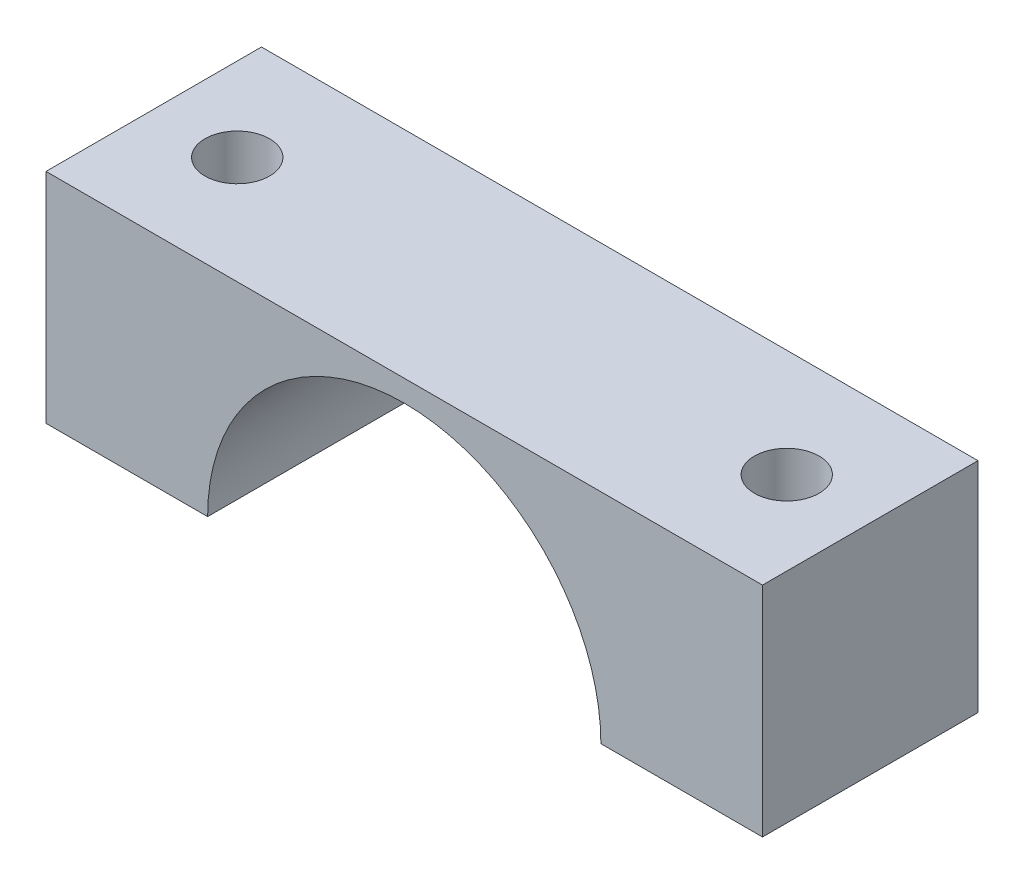
ISO-10303-21;
HEADER;
FILE_DESCRIPTION(('STEP AP214'),'2;1');
FILE_NAME('part.step','',(''),(''),'','','');
FILE_SCHEMA(('AUTOMOTIVE_DESIGN { 1 0 10303 214 1 1 1 1 }'));
ENDSEC;
DATA;
#1=APPLICATION_CONTEXT('core data for automotive mechanical design processes');
#2=APPLICATION_PROTOCOL_DEFINITION('international standard','automotive_design',2000,#1);
#3=PRODUCT_CONTEXT('',#1,'mechanical');
#4=PRODUCT('Part','Part','',(#3));
#5=PRODUCT_RELATED_PRODUCT_CATEGORY('part','',(#4));
#6=PRODUCT_DEFINITION_FORMATION('','',#4);
#7=PRODUCT_DEFINITION_CONTEXT('part definition',#1,'design');
#8=PRODUCT_DEFINITION('design','',#6,#7);
#9=PRODUCT_DEFINITION_SHAPE('','',#8);
#10=(LENGTH_UNIT() NAMED_UNIT(*) SI_UNIT(.MILLI.,.METRE.));
#11=(NAMED_UNIT(*) PLANE_ANGLE_UNIT() SI_UNIT($,.RADIAN.));
#12=(NAMED_UNIT(*) SI_UNIT($,.STERADIAN.) SOLID_ANGLE_UNIT());
#13=UNCERTAINTY_MEASURE_WITH_UNIT(LENGTH_MEASURE(1.E-05),#10,'distance_accuracy_value','');
#14=(GEOMETRIC_REPRESENTATION_CONTEXT(3) GLOBAL_UNCERTAINTY_ASSIGNED_CONTEXT((#13)) GLOBAL_UNIT_ASSIGNED_CONTEXT((#10,
#11,#12)) REPRESENTATION_CONTEXT('',''));
#15=CARTESIAN_POINT('',(0.,0.,0.));
#16=DIRECTION('',(0.,0.,1.));
#17=DIRECTION('',(1.,0.,0.));
#18=AXIS2_PLACEMENT_3D('',#15,#16,#17);
#19=CARTESIAN_POINT('',(-33.25,0.,20.));
#20=DIRECTION('',(1.,0.,0.));
#21=DIRECTION('',(0.,0.,-1.));
#22=AXIS2_PLACEMENT_3D('',#19,#20,#21);
#23=PLANE('',#22);
#24=DIRECTION('',(0.,-1.,0.));
#25=VECTOR('',#24,1.);
#26=CARTESIAN_POINT('',(-33.25,0.,0.));
#27=LINE('',#26,#25);
#28=CARTESIAN_POINT('',(-33.25,20.25,0.));
#29=VERTEX_POINT('',#28);
#30=CARTESIAN_POINT('',(-33.25,0.,0.));
#31=VERTEX_POINT('',#30);
#32=EDGE_CURVE('E121',#29,#31,#27,.T.);
#33=ORIENTED_EDGE('',*,*,#32,.T.);
#34=DIRECTION('',(0.,0.,-1.));
#35=VECTOR('',#34,1.);
#36=CARTESIAN_POINT('',(-33.25,0.,20.));
#37=LINE('',#36,#35);
#38=CARTESIAN_POINT('',(-33.25,0.,20.));
#39=VERTEX_POINT('',#38);
#40=EDGE_CURVE('E11',#39,#31,#37,.T.);
#41=ORIENTED_EDGE('',*,*,#40,.F.);
#42=DIRECTION('',(0.,-1.,0.));
#43=VECTOR('',#42,1.);
#44=CARTESIAN_POINT('',(-33.25,0.,20.));
#45=LINE('',#44,#43);
#46=CARTESIAN_POINT('',(-33.25,20.25,20.));
#47=VERTEX_POINT('',#46);
#48=EDGE_CURVE('E132',#47,#39,#45,.T.);
#49=ORIENTED_EDGE('',*,*,#48,.F.);
#50=DIRECTION('',(0.,0.,-1.));
#51=VECTOR('',#50,1.);
#52=CARTESIAN_POINT('',(-33.25,20.25,20.));
#53=LINE('',#52,#51);
#54=EDGE_CURVE('E117',#47,#29,#53,.T.);
#55=ORIENTED_EDGE('',*,*,#54,.T.);
#56=EDGE_LOOP('',(#33,#41,#49,#55));
#57=FACE_BOUND('',#56,.T.);
#58=ADVANCED_FACE('F37',(#57),#23,.F.);
#59=CARTESIAN_POINT('',(-33.25,0.,20.));
#60=DIRECTION('',(0.,1.,0.));
#61=DIRECTION('',(0.,0.,1.));
#62=AXIS2_PLACEMENT_3D('',#59,#60,#61);
#63=PLANE('',#62);
#64=CARTESIAN_POINT('',(-25.5,0.,10.));
#65=DIRECTION('',(0.,1.,0.));
#66=DIRECTION('',(0.,0.,1.));
#67=AXIS2_PLACEMENT_3D('',#64,#65,#66);
#68=CIRCLE('',#67,3.);
#69=CARTESIAN_POINT('',(-25.5,0.,13.));
#70=VERTEX_POINT('',#69);
#71=EDGE_CURVE('E125',#70,#70,#68,.T.);
#72=ORIENTED_EDGE('',*,*,#71,.T.);
#73=EDGE_LOOP('',(#72));
#74=FACE_BOUND('',#73,.T.);
#75=DIRECTION('',(1.,0.,0.));
#76=VECTOR('',#75,1.);
#77=CARTESIAN_POINT('',(-33.25,0.,0.));
#78=LINE('',#77,#76);
#79=CARTESIAN_POINT('',(-18.25,0.,0.));
#80=VERTEX_POINT('',#79);
#81=EDGE_CURVE('E124',#31,#80,#78,.T.);
#82=ORIENTED_EDGE('',*,*,#81,.T.);
#83=DIRECTION('',(0.,0.,-1.));
#84=VECTOR('',#83,1.);
#85=CARTESIAN_POINT('',(-18.25,0.,20.));
#86=LINE('',#85,#84);
#87=CARTESIAN_POINT('',(-18.25,0.,20.));
#88=VERTEX_POINT('',#87);
#89=EDGE_CURVE('E45',#88,#80,#86,.T.);
#90=ORIENTED_EDGE('',*,*,#89,.F.);
#91=DIRECTION('',(1.,0.,0.));
#92=VECTOR('',#91,1.);
#93=CARTESIAN_POINT('',(-33.25,0.,20.));
#94=LINE('',#93,#92);
#95=EDGE_CURVE('E90',#39,#88,#94,.T.);
#96=ORIENTED_EDGE('',*,*,#95,.F.);
#97=ORIENTED_EDGE('',*,*,#40,.T.);
#98=EDGE_LOOP('',(#82,#90,#96,#97));
#99=FACE_BOUND('',#98,.T.);
#100=ADVANCED_FACE('F159',(#74,#99),#63,.F.);
#101=CARTESIAN_POINT('',(0.,0.,20.));
#102=DIRECTION('',(0.,0.,-1.));
#103=DIRECTION('',(-1.,0.,0.));
#104=AXIS2_PLACEMENT_3D('',#101,#102,#103);
#105=CYLINDRICAL_SURFACE('',#104,18.25);
#106=CARTESIAN_POINT('',(0.,0.,0.));
#107=DIRECTION('',(0.,0.,-1.));
#108=DIRECTION('',(1.,0.,0.));
#109=AXIS2_PLACEMENT_3D('',#106,#107,#108);
#110=CIRCLE('',#109,18.25);
#111=CARTESIAN_POINT('',(18.25,0.,0.));
#112=VERTEX_POINT('',#111);
#113=EDGE_CURVE('E127',#80,#112,#110,.T.);
#114=ORIENTED_EDGE('',*,*,#113,.T.);
#115=DIRECTION('',(0.,0.,-1.));
#116=VECTOR('',#115,1.);
#117=CARTESIAN_POINT('',(18.25,0.,20.));
#118=LINE('',#117,#116);
#119=CARTESIAN_POINT('',(18.25,0.,20.));
#120=VERTEX_POINT('',#119);
#121=EDGE_CURVE('E112',#120,#112,#118,.T.);
#122=ORIENTED_EDGE('',*,*,#121,.F.);
#123=CARTESIAN_POINT('',(0.,0.,20.));
#124=DIRECTION('',(0.,0.,-1.));
#125=DIRECTION('',(1.,0.,0.));
#126=AXIS2_PLACEMENT_3D('',#123,#124,#125);
#127=CIRCLE('',#126,18.25);
#128=EDGE_CURVE('E103',#88,#120,#127,.T.);
#129=ORIENTED_EDGE('',*,*,#128,.F.);
#130=ORIENTED_EDGE('',*,*,#89,.T.);
#131=EDGE_LOOP('',(#114,#122,#129,#130));
#132=FACE_BOUND('',#131,.T.);
#133=ADVANCED_FACE('F138',(#132),#105,.F.);
#134=CARTESIAN_POINT('',(18.25,0.,20.));
#135=DIRECTION('',(0.,1.,0.));
#136=DIRECTION('',(0.,0.,1.));
#137=AXIS2_PLACEMENT_3D('',#134,#135,#136);
#138=PLANE('',#137);
#139=CARTESIAN_POINT('',(25.5,0.,10.));
#140=DIRECTION('',(0.,1.,0.));
#141=DIRECTION('',(0.,0.,1.));
#142=AXIS2_PLACEMENT_3D('',#139,#140,#141);
#143=CIRCLE('',#142,3.);
#144=CARTESIAN_POINT('',(25.5,0.,13.));
#145=VERTEX_POINT('',#144);
#146=EDGE_CURVE('E176',#145,#145,#143,.T.);
#147=ORIENTED_EDGE('',*,*,#146,.T.);
#148=EDGE_LOOP('',(#147));
#149=FACE_BOUND('',#148,.T.);
#150=DIRECTION('',(1.,0.,0.));
#151=VECTOR('',#150,1.);
#152=CARTESIAN_POINT('',(18.25,0.,0.));
#153=LINE('',#152,#151);
#154=CARTESIAN_POINT('',(33.25,0.,0.));
#155=VERTEX_POINT('',#154);
#156=EDGE_CURVE('E111',#112,#155,#153,.T.);
#157=ORIENTED_EDGE('',*,*,#156,.T.);
#158=DIRECTION('',(0.,0.,-1.));
#159=VECTOR('',#158,1.);
#160=CARTESIAN_POINT('',(33.25,0.,20.));
#161=LINE('',#160,#159);
#162=CARTESIAN_POINT('',(33.25,0.,20.));
#163=VERTEX_POINT('',#162);
#164=EDGE_CURVE('E108',#163,#155,#161,.T.);
#165=ORIENTED_EDGE('',*,*,#164,.F.);
#166=DIRECTION('',(1.,0.,0.));
#167=VECTOR('',#166,1.);
#168=CARTESIAN_POINT('',(18.25,0.,20.));
#169=LINE('',#168,#167);
#170=EDGE_CURVE('E97',#120,#163,#169,.T.);
#171=ORIENTED_EDGE('',*,*,#170,.F.);
#172=ORIENTED_EDGE('',*,*,#121,.T.);
#173=EDGE_LOOP('',(#157,#165,#171,#172));
#174=FACE_BOUND('',#173,.T.);
#175=ADVANCED_FACE('F109',(#149,#174),#138,.F.);
#176=CARTESIAN_POINT('',(33.25,20.25,20.));
#177=DIRECTION('',(-1.,0.,0.));
#178=DIRECTION('',(0.,0.,1.));
#179=AXIS2_PLACEMENT_3D('',#176,#177,#178);
#180=PLANE('',#179);
#181=DIRECTION('',(0.,1.,0.));
#182=VECTOR('',#181,1.);
#183=CARTESIAN_POINT('',(33.25,20.25,0.));
#184=LINE('',#183,#182);
#185=CARTESIAN_POINT('',(33.25,20.25,0.));
#186=VERTEX_POINT('',#185);
#187=EDGE_CURVE('E76',#155,#186,#184,.T.);
#188=ORIENTED_EDGE('',*,*,#187,.T.);
#189=DIRECTION('',(0.,0.,-1.));
#190=VECTOR('',#189,1.);
#191=CARTESIAN_POINT('',(33.25,20.25,20.));
#192=LINE('',#191,#190);
#193=CARTESIAN_POINT('',(33.25,20.25,20.));
#194=VERTEX_POINT('',#193);
#195=EDGE_CURVE('E113',#194,#186,#192,.T.);
#196=ORIENTED_EDGE('',*,*,#195,.F.);
#197=DIRECTION('',(0.,1.,0.));
#198=VECTOR('',#197,1.);
#199=CARTESIAN_POINT('',(33.25,20.25,20.));
#200=LINE('',#199,#198);
#201=EDGE_CURVE('E101',#163,#194,#200,.T.);
#202=ORIENTED_EDGE('',*,*,#201,.F.);
#203=ORIENTED_EDGE('',*,*,#164,.T.);
#204=EDGE_LOOP('',(#188,#196,#202,#203));
#205=FACE_BOUND('',#204,.T.);
#206=ADVANCED_FACE('F115',(#205),#180,.F.);
#207=CARTESIAN_POINT('',(-33.25,20.25,20.));
#208=DIRECTION('',(0.,-1.,0.));
#209=DIRECTION('',(0.,0.,-1.));
#210=AXIS2_PLACEMENT_3D('',#207,#208,#209);
#211=PLANE('',#210);
#212=CARTESIAN_POINT('',(-25.5,20.25,10.));
#213=DIRECTION('',(0.,1.,0.));
#214=DIRECTION('',(0.,0.,1.));
#215=AXIS2_PLACEMENT_3D('',#212,#213,#214);
#216=CIRCLE('',#215,3.);
#217=CARTESIAN_POINT('',(-25.5,20.25,13.));
#218=VERTEX_POINT('',#217);
#219=EDGE_CURVE('E181',#218,#218,#216,.T.);
#220=ORIENTED_EDGE('',*,*,#219,.F.);
#221=EDGE_LOOP('',(#220));
#222=FACE_BOUND('',#221,.T.);
#223=CARTESIAN_POINT('',(25.5,20.25,10.));
#224=DIRECTION('',(0.,1.,0.));
#225=DIRECTION('',(0.,0.,1.));
#226=AXIS2_PLACEMENT_3D('',#223,#224,#225);
#227=CIRCLE('',#226,3.);
#228=CARTESIAN_POINT('',(25.5,20.25,13.));
#229=VERTEX_POINT('',#228);
#230=EDGE_CURVE('E178',#229,#229,#227,.T.);
#231=ORIENTED_EDGE('',*,*,#230,.F.);
#232=EDGE_LOOP('',(#231));
#233=FACE_BOUND('',#232,.T.);
#234=DIRECTION('',(-1.,0.,0.));
#235=VECTOR('',#234,1.);
#236=CARTESIAN_POINT('',(-33.25,20.25,0.));
#237=LINE('',#236,#235);
#238=EDGE_CURVE('E82',#186,#29,#237,.T.);
#239=ORIENTED_EDGE('',*,*,#238,.T.);
#240=ORIENTED_EDGE('',*,*,#54,.F.);
#241=DIRECTION('',(-1.,0.,0.));
#242=VECTOR('',#241,1.);
#243=CARTESIAN_POINT('',(-33.25,20.25,20.));
#244=LINE('',#243,#242);
#245=EDGE_CURVE('E53',#194,#47,#244,.T.);
#246=ORIENTED_EDGE('',*,*,#245,.F.);
#247=ORIENTED_EDGE('',*,*,#195,.T.);
#248=EDGE_LOOP('',(#239,#240,#246,#247));
#249=FACE_BOUND('',#248,.T.);
#250=ADVANCED_FACE('F145',(#222,#233,#249),#211,.F.);
#251=CARTESIAN_POINT('',(0.,0.,20.));
#252=DIRECTION('',(0.,0.,1.));
#253=DIRECTION('',(1.,0.,0.));
#254=AXIS2_PLACEMENT_3D('',#251,#252,#253);
#255=PLANE('',#254);
#256=ORIENTED_EDGE('',*,*,#48,.T.);
#257=ORIENTED_EDGE('',*,*,#95,.T.);
#258=ORIENTED_EDGE('',*,*,#128,.T.);
#259=ORIENTED_EDGE('',*,*,#170,.T.);
#260=ORIENTED_EDGE('',*,*,#201,.T.);
#261=ORIENTED_EDGE('',*,*,#245,.T.);
#262=EDGE_LOOP('',(#256,#257,#258,#259,#260,#261));
#263=FACE_BOUND('',#262,.T.);
#264=ADVANCED_FACE('F99',(#263),#255,.T.);
#265=CARTESIAN_POINT('',(0.,0.,0.));
#266=DIRECTION('',(0.,0.,1.));
#267=DIRECTION('',(1.,0.,0.));
#268=AXIS2_PLACEMENT_3D('',#265,#266,#267);
#269=PLANE('',#268);
#270=ORIENTED_EDGE('',*,*,#32,.F.);
#271=ORIENTED_EDGE('',*,*,#238,.F.);
#272=ORIENTED_EDGE('',*,*,#187,.F.);
#273=ORIENTED_EDGE('',*,*,#156,.F.);
#274=ORIENTED_EDGE('',*,*,#113,.F.);
#275=ORIENTED_EDGE('',*,*,#81,.F.);
#276=EDGE_LOOP('',(#270,#271,#272,#273,#274,#275));
#277=FACE_BOUND('',#276,.T.);
#278=ADVANCED_FACE('F141',(#277),#269,.F.);
#279=CARTESIAN_POINT('',(25.5,0.,10.));
#280=DIRECTION('',(0.,1.,0.));
#281=DIRECTION('',(0.,0.,1.));
#282=AXIS2_PLACEMENT_3D('',#279,#280,#281);
#283=CYLINDRICAL_SURFACE('',#282,3.);
#284=ORIENTED_EDGE('',*,*,#146,.F.);
#285=EDGE_LOOP('',(#284));
#286=FACE_BOUND('',#285,.T.);
#287=ORIENTED_EDGE('',*,*,#230,.T.);
#288=EDGE_LOOP('',(#287));
#289=FACE_BOUND('',#288,.T.);
#290=ADVANCED_FACE('F193',(#286,#289),#283,.F.);
#291=CARTESIAN_POINT('',(-25.5,0.,10.));
#292=DIRECTION('',(0.,1.,0.));
#293=DIRECTION('',(0.,0.,1.));
#294=AXIS2_PLACEMENT_3D('',#291,#292,#293);
#295=CYLINDRICAL_SURFACE('',#294,3.);
#296=ORIENTED_EDGE('',*,*,#71,.F.);
#297=EDGE_LOOP('',(#296));
#298=FACE_BOUND('',#297,.T.);
#299=ORIENTED_EDGE('',*,*,#219,.T.);
#300=EDGE_LOOP('',(#299));
#301=FACE_BOUND('',#300,.T.);
#302=ADVANCED_FACE('F190',(#298,#301),#295,.F.);
#303=CLOSED_SHELL('',(#58,#100,#133,#175,#206,#250,#264,#278,#290,#302));
#304=MANIFOLD_SOLID_BREP('B2',#303);
#305=ADVANCED_BREP_SHAPE_REPRESENTATION('',(#18,#304),#14);
#306=SHAPE_DEFINITION_REPRESENTATION(#9,#305);
ENDSEC;
END-ISO-10303-21;
